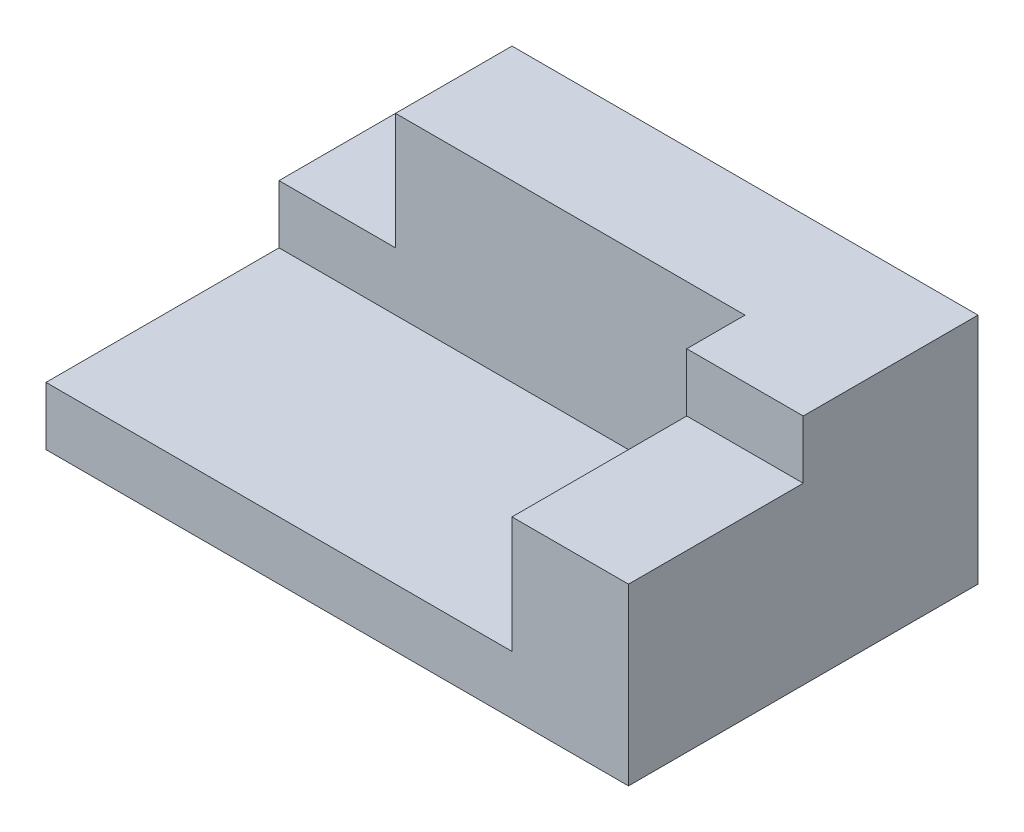
ISO-10303-21;
HEADER;
FILE_DESCRIPTION(('STEP AP214'),'2;1');
FILE_NAME('part.step','',(''),(''),'','','');
FILE_SCHEMA(('AUTOMOTIVE_DESIGN { 1 0 10303 214 1 1 1 1 }'));
ENDSEC;
DATA;
#1=APPLICATION_CONTEXT('core data for automotive mechanical design processes');
#2=APPLICATION_PROTOCOL_DEFINITION('international standard','automotive_design',2000,#1);
#3=PRODUCT_CONTEXT('',#1,'mechanical');
#4=PRODUCT('Part','Part','',(#3));
#5=PRODUCT_RELATED_PRODUCT_CATEGORY('part','',(#4));
#6=PRODUCT_DEFINITION_FORMATION('','',#4);
#7=PRODUCT_DEFINITION_CONTEXT('part definition',#1,'design');
#8=PRODUCT_DEFINITION('design','',#6,#7);
#9=PRODUCT_DEFINITION_SHAPE('','',#8);
#10=(LENGTH_UNIT() NAMED_UNIT(*) SI_UNIT(.MILLI.,.METRE.));
#11=(NAMED_UNIT(*) PLANE_ANGLE_UNIT() SI_UNIT($,.RADIAN.));
#12=(NAMED_UNIT(*) SI_UNIT($,.STERADIAN.) SOLID_ANGLE_UNIT());
#13=UNCERTAINTY_MEASURE_WITH_UNIT(LENGTH_MEASURE(1.E-05),#10,'distance_accuracy_value','');
#14=(GEOMETRIC_REPRESENTATION_CONTEXT(3) GLOBAL_UNCERTAINTY_ASSIGNED_CONTEXT((#13)) GLOBAL_UNIT_ASSIGNED_CONTEXT((#10,
#11,#12)) REPRESENTATION_CONTEXT('',''));
#15=CARTESIAN_POINT('',(0.,0.,0.));
#16=DIRECTION('',(0.,0.,1.));
#17=DIRECTION('',(1.,0.,0.));
#18=AXIS2_PLACEMENT_3D('',#15,#16,#17);
#19=CARTESIAN_POINT('',(-50.,10.,0.));
#20=DIRECTION('',(1.,0.,0.));
#21=DIRECTION('',(0.,0.,-1.));
#22=AXIS2_PLACEMENT_3D('',#19,#20,#21);
#23=PLANE('',#22);
#24=DIRECTION('',(0.,0.,1.));
#25=VECTOR('',#24,1.);
#26=CARTESIAN_POINT('',(-50.,0.,0.));
#27=LINE('',#26,#25);
#28=CARTESIAN_POINT('',(-50.,0.,-30.));
#29=VERTEX_POINT('',#28);
#30=CARTESIAN_POINT('',(-50.,0.,30.));
#31=VERTEX_POINT('',#30);
#32=EDGE_CURVE('E197',#29,#31,#27,.T.);
#33=ORIENTED_EDGE('',*,*,#32,.T.);
#34=DIRECTION('',(0.,-1.,0.));
#35=VECTOR('',#34,1.);
#36=CARTESIAN_POINT('',(-50.,10.,30.));
#37=LINE('',#36,#35);
#38=CARTESIAN_POINT('',(-50.,10.,30.));
#39=VERTEX_POINT('',#38);
#40=EDGE_CURVE('E11',#39,#31,#37,.T.);
#41=ORIENTED_EDGE('',*,*,#40,.F.);
#42=DIRECTION('',(0.,0.,1.));
#43=VECTOR('',#42,1.);
#44=CARTESIAN_POINT('',(-50.,10.,0.));
#45=LINE('',#44,#43);
#46=CARTESIAN_POINT('',(-50.,10.,-10.));
#47=VERTEX_POINT('',#46);
#48=EDGE_CURVE('E200',#47,#39,#45,.T.);
#49=ORIENTED_EDGE('',*,*,#48,.F.);
#50=DIRECTION('',(0.,-1.,0.));
#51=VECTOR('',#50,1.);
#52=CARTESIAN_POINT('',(-50.,20.,-10.));
#53=LINE('',#52,#51);
#54=CARTESIAN_POINT('',(-50.,20.,-10.));
#55=VERTEX_POINT('',#54);
#56=EDGE_CURVE('E128',#55,#47,#53,.T.);
#57=ORIENTED_EDGE('',*,*,#56,.F.);
#58=DIRECTION('',(0.,0.,1.));
#59=VECTOR('',#58,1.);
#60=CARTESIAN_POINT('',(-50.,20.,0.));
#61=LINE('',#60,#59);
#62=CARTESIAN_POINT('',(-50.,20.,-30.));
#63=VERTEX_POINT('',#62);
#64=EDGE_CURVE('E131',#63,#55,#61,.T.);
#65=ORIENTED_EDGE('',*,*,#64,.F.);
#66=DIRECTION('',(0.,-1.,0.));
#67=VECTOR('',#66,1.);
#68=CARTESIAN_POINT('',(-50.,20.,-30.));
#69=LINE('',#68,#67);
#70=EDGE_CURVE('E119',#63,#29,#69,.T.);
#71=ORIENTED_EDGE('',*,*,#70,.T.);
#72=EDGE_LOOP('',(#33,#41,#49,#57,#65,#71));
#73=FACE_BOUND('',#72,.T.);
#74=ADVANCED_FACE('F35',(#73),#23,.F.);
#75=CARTESIAN_POINT('',(0.,10.,30.));
#76=DIRECTION('',(0.,0.,-1.));
#77=DIRECTION('',(-1.,0.,0.));
#78=AXIS2_PLACEMENT_3D('',#75,#76,#77);
#79=PLANE('',#78);
#80=DIRECTION('',(1.,0.,0.));
#81=VECTOR('',#80,1.);
#82=CARTESIAN_POINT('',(0.,0.,30.));
#83=LINE('',#82,#81);
#84=CARTESIAN_POINT('',(50.,0.,30.));
#85=VERTEX_POINT('',#84);
#86=EDGE_CURVE('E201',#31,#85,#83,.T.);
#87=ORIENTED_EDGE('',*,*,#86,.T.);
#88=DIRECTION('',(0.,-1.,0.));
#89=VECTOR('',#88,1.);
#90=CARTESIAN_POINT('',(50.,30.,30.));
#91=LINE('',#90,#89);
#92=CARTESIAN_POINT('',(50.,30.,30.));
#93=VERTEX_POINT('',#92);
#94=EDGE_CURVE('E187',#93,#85,#91,.T.);
#95=ORIENTED_EDGE('',*,*,#94,.F.);
#96=DIRECTION('',(1.,0.,0.));
#97=VECTOR('',#96,1.);
#98=CARTESIAN_POINT('',(0.,30.,30.));
#99=LINE('',#98,#97);
#100=CARTESIAN_POINT('',(30.,30.,30.));
#101=VERTEX_POINT('',#100);
#102=EDGE_CURVE('E179',#101,#93,#99,.T.);
#103=ORIENTED_EDGE('',*,*,#102,.F.);
#104=DIRECTION('',(0.,-1.,0.));
#105=VECTOR('',#104,1.);
#106=CARTESIAN_POINT('',(30.,30.,30.));
#107=LINE('',#106,#105);
#108=CARTESIAN_POINT('',(30.,10.,30.));
#109=VERTEX_POINT('',#108);
#110=EDGE_CURVE('E192',#101,#109,#107,.T.);
#111=ORIENTED_EDGE('',*,*,#110,.T.);
#112=DIRECTION('',(1.,0.,0.));
#113=VECTOR('',#112,1.);
#114=CARTESIAN_POINT('',(0.,10.,30.));
#115=LINE('',#114,#113);
#116=EDGE_CURVE('E203',#39,#109,#115,.T.);
#117=ORIENTED_EDGE('',*,*,#116,.F.);
#118=ORIENTED_EDGE('',*,*,#40,.T.);
#119=EDGE_LOOP('',(#87,#95,#103,#111,#117,#118));
#120=FACE_BOUND('',#119,.T.);
#121=ADVANCED_FACE('F216',(#120),#79,.F.);
#122=CARTESIAN_POINT('',(0.,10.,0.));
#123=DIRECTION('',(0.,1.,0.));
#124=DIRECTION('',(0.,0.,1.));
#125=AXIS2_PLACEMENT_3D('',#122,#123,#124);
#126=PLANE('',#125);
#127=DIRECTION('',(1.,0.,0.));
#128=VECTOR('',#127,1.);
#129=CARTESIAN_POINT('',(0.,10.,-10.));
#130=LINE('',#129,#128);
#131=CARTESIAN_POINT('',(30.,10.,-10.));
#132=VERTEX_POINT('',#131);
#133=EDGE_CURVE('E198',#47,#132,#130,.T.);
#134=ORIENTED_EDGE('',*,*,#133,.F.);
#135=ORIENTED_EDGE('',*,*,#48,.T.);
#136=ORIENTED_EDGE('',*,*,#116,.T.);
#137=DIRECTION('',(0.,0.,-1.));
#138=VECTOR('',#137,1.);
#139=CARTESIAN_POINT('',(30.,10.,0.));
#140=LINE('',#139,#138);
#141=EDGE_CURVE('E43',#109,#132,#140,.T.);
#142=ORIENTED_EDGE('',*,*,#141,.T.);
#143=EDGE_LOOP('',(#134,#135,#136,#142));
#144=FACE_BOUND('',#143,.T.);
#145=ADVANCED_FACE('F213',(#144),#126,.T.);
#146=CARTESIAN_POINT('',(0.,0.,0.));
#147=DIRECTION('',(0.,1.,0.));
#148=DIRECTION('',(0.,0.,1.));
#149=AXIS2_PLACEMENT_3D('',#146,#147,#148);
#150=PLANE('',#149);
#151=ORIENTED_EDGE('',*,*,#32,.F.);
#152=DIRECTION('',(1.,0.,0.));
#153=VECTOR('',#152,1.);
#154=CARTESIAN_POINT('',(0.,0.,-30.));
#155=LINE('',#154,#153);
#156=CARTESIAN_POINT('',(50.,0.,-30.));
#157=VERTEX_POINT('',#156);
#158=EDGE_CURVE('E126',#29,#157,#155,.T.);
#159=ORIENTED_EDGE('',*,*,#158,.T.);
#160=DIRECTION('',(0.,0.,1.));
#161=VECTOR('',#160,1.);
#162=CARTESIAN_POINT('',(50.,0.,0.));
#163=LINE('',#162,#161);
#164=EDGE_CURVE('E175',#157,#85,#163,.T.);
#165=ORIENTED_EDGE('',*,*,#164,.T.);
#166=ORIENTED_EDGE('',*,*,#86,.F.);
#167=EDGE_LOOP('',(#151,#159,#165,#166));
#168=FACE_BOUND('',#167,.T.);
#169=ADVANCED_FACE('F235',(#168),#150,.F.);
#170=CARTESIAN_POINT('',(30.,30.,0.));
#171=DIRECTION('',(-1.,0.,0.));
#172=DIRECTION('',(0.,0.,1.));
#173=AXIS2_PLACEMENT_3D('',#170,#171,#172);
#174=PLANE('',#173);
#175=ORIENTED_EDGE('',*,*,#141,.F.);
#176=ORIENTED_EDGE('',*,*,#110,.F.);
#177=DIRECTION('',(0.,0.,-1.));
#178=VECTOR('',#177,1.);
#179=CARTESIAN_POINT('',(30.,30.,0.));
#180=LINE('',#179,#178);
#181=CARTESIAN_POINT('',(30.,30.,0.));
#182=VERTEX_POINT('',#181);
#183=EDGE_CURVE('E176',#101,#182,#180,.T.);
#184=ORIENTED_EDGE('',*,*,#183,.T.);
#185=DIRECTION('',(0.,-1.,0.));
#186=VECTOR('',#185,1.);
#187=CARTESIAN_POINT('',(30.,40.,0.));
#188=LINE('',#187,#186);
#189=CARTESIAN_POINT('',(30.,40.,0.));
#190=VERTEX_POINT('',#189);
#191=EDGE_CURVE('E168',#190,#182,#188,.T.);
#192=ORIENTED_EDGE('',*,*,#191,.F.);
#193=DIRECTION('',(0.,0.,-1.));
#194=VECTOR('',#193,1.);
#195=CARTESIAN_POINT('',(30.,40.,0.));
#196=LINE('',#195,#194);
#197=CARTESIAN_POINT('',(30.,40.,-10.));
#198=VERTEX_POINT('',#197);
#199=EDGE_CURVE('E149',#190,#198,#196,.T.);
#200=ORIENTED_EDGE('',*,*,#199,.T.);
#201=DIRECTION('',(0.,-1.,0.));
#202=VECTOR('',#201,1.);
#203=CARTESIAN_POINT('',(30.,40.,-10.));
#204=LINE('',#203,#202);
#205=EDGE_CURVE('E170',#198,#132,#204,.T.);
#206=ORIENTED_EDGE('',*,*,#205,.T.);
#207=EDGE_LOOP('',(#175,#176,#184,#192,#200,#206));
#208=FACE_BOUND('',#207,.T.);
#209=ADVANCED_FACE('F222',(#208),#174,.T.);
#210=CARTESIAN_POINT('',(50.,30.,0.));
#211=DIRECTION('',(1.,0.,0.));
#212=DIRECTION('',(0.,0.,-1.));
#213=AXIS2_PLACEMENT_3D('',#210,#211,#212);
#214=PLANE('',#213);
#215=ORIENTED_EDGE('',*,*,#164,.F.);
#216=DIRECTION('',(0.,-1.,0.));
#217=VECTOR('',#216,1.);
#218=CARTESIAN_POINT('',(50.,40.,-30.));
#219=LINE('',#218,#217);
#220=CARTESIAN_POINT('',(50.,40.,-30.));
#221=VERTEX_POINT('',#220);
#222=EDGE_CURVE('E163',#221,#157,#219,.T.);
#223=ORIENTED_EDGE('',*,*,#222,.F.);
#224=DIRECTION('',(0.,0.,1.));
#225=VECTOR('',#224,1.);
#226=CARTESIAN_POINT('',(50.,40.,0.));
#227=LINE('',#226,#225);
#228=CARTESIAN_POINT('',(50.,40.,0.));
#229=VERTEX_POINT('',#228);
#230=EDGE_CURVE('E155',#221,#229,#227,.T.);
#231=ORIENTED_EDGE('',*,*,#230,.T.);
#232=DIRECTION('',(0.,-1.,0.));
#233=VECTOR('',#232,1.);
#234=CARTESIAN_POINT('',(50.,40.,0.));
#235=LINE('',#234,#233);
#236=CARTESIAN_POINT('',(50.,30.,0.));
#237=VERTEX_POINT('',#236);
#238=EDGE_CURVE('E165',#229,#237,#235,.T.);
#239=ORIENTED_EDGE('',*,*,#238,.T.);
#240=DIRECTION('',(0.,0.,1.));
#241=VECTOR('',#240,1.);
#242=CARTESIAN_POINT('',(50.,30.,0.));
#243=LINE('',#242,#241);
#244=EDGE_CURVE('E181',#237,#93,#243,.T.);
#245=ORIENTED_EDGE('',*,*,#244,.T.);
#246=ORIENTED_EDGE('',*,*,#94,.T.);
#247=EDGE_LOOP('',(#215,#223,#231,#239,#245,#246));
#248=FACE_BOUND('',#247,.T.);
#249=ADVANCED_FACE('F236',(#248),#214,.T.);
#250=CARTESIAN_POINT('',(0.,30.,0.));
#251=DIRECTION('',(0.,1.,0.));
#252=DIRECTION('',(0.,0.,1.));
#253=AXIS2_PLACEMENT_3D('',#250,#251,#252);
#254=PLANE('',#253);
#255=ORIENTED_EDGE('',*,*,#183,.F.);
#256=ORIENTED_EDGE('',*,*,#102,.T.);
#257=ORIENTED_EDGE('',*,*,#244,.F.);
#258=DIRECTION('',(-1.,0.,0.));
#259=VECTOR('',#258,1.);
#260=CARTESIAN_POINT('',(0.,30.,0.));
#261=LINE('',#260,#259);
#262=EDGE_CURVE('E184',#237,#182,#261,.T.);
#263=ORIENTED_EDGE('',*,*,#262,.T.);
#264=EDGE_LOOP('',(#255,#256,#257,#263));
#265=FACE_BOUND('',#264,.T.);
#266=ADVANCED_FACE('F239',(#265),#254,.T.);
#267=CARTESIAN_POINT('',(-30.,40.,0.));
#268=DIRECTION('',(1.,0.,0.));
#269=DIRECTION('',(0.,0.,-1.));
#270=AXIS2_PLACEMENT_3D('',#267,#268,#269);
#271=PLANE('',#270);
#272=DIRECTION('',(0.,-1.,0.));
#273=VECTOR('',#272,1.);
#274=CARTESIAN_POINT('',(-30.,40.,-30.));
#275=LINE('',#274,#273);
#276=CARTESIAN_POINT('',(-30.,40.,-30.));
#277=VERTEX_POINT('',#276);
#278=CARTESIAN_POINT('',(-30.,20.,-30.));
#279=VERTEX_POINT('',#278);
#280=EDGE_CURVE('E56',#277,#279,#275,.T.);
#281=ORIENTED_EDGE('',*,*,#280,.T.);
#282=DIRECTION('',(0.,0.,1.));
#283=VECTOR('',#282,1.);
#284=CARTESIAN_POINT('',(-30.,20.,0.));
#285=LINE('',#284,#283);
#286=CARTESIAN_POINT('',(-30.,20.,-10.));
#287=VERTEX_POINT('',#286);
#288=EDGE_CURVE('E51',#279,#287,#285,.T.);
#289=ORIENTED_EDGE('',*,*,#288,.T.);
#290=DIRECTION('',(0.,-1.,0.));
#291=VECTOR('',#290,1.);
#292=CARTESIAN_POINT('',(-30.,40.,-10.));
#293=LINE('',#292,#291);
#294=CARTESIAN_POINT('',(-30.,40.,-10.));
#295=VERTEX_POINT('',#294);
#296=EDGE_CURVE('E173',#295,#287,#293,.T.);
#297=ORIENTED_EDGE('',*,*,#296,.F.);
#298=DIRECTION('',(0.,0.,1.));
#299=VECTOR('',#298,1.);
#300=CARTESIAN_POINT('',(-30.,40.,0.));
#301=LINE('',#300,#299);
#302=EDGE_CURVE('E144',#277,#295,#301,.T.);
#303=ORIENTED_EDGE('',*,*,#302,.F.);
#304=EDGE_LOOP('',(#281,#289,#297,#303));
#305=FACE_BOUND('',#304,.T.);
#306=ADVANCED_FACE('F227',(#305),#271,.F.);
#307=CARTESIAN_POINT('',(0.,40.,-10.));
#308=DIRECTION('',(0.,0.,-1.));
#309=DIRECTION('',(-1.,0.,0.));
#310=AXIS2_PLACEMENT_3D('',#307,#308,#309);
#311=PLANE('',#310);
#312=ORIENTED_EDGE('',*,*,#133,.T.);
#313=ORIENTED_EDGE('',*,*,#205,.F.);
#314=DIRECTION('',(1.,0.,0.));
#315=VECTOR('',#314,1.);
#316=CARTESIAN_POINT('',(0.,40.,-10.));
#317=LINE('',#316,#315);
#318=EDGE_CURVE('E147',#295,#198,#317,.T.);
#319=ORIENTED_EDGE('',*,*,#318,.F.);
#320=ORIENTED_EDGE('',*,*,#296,.T.);
#321=DIRECTION('',(1.,0.,0.));
#322=VECTOR('',#321,1.);
#323=CARTESIAN_POINT('',(0.,20.,-10.));
#324=LINE('',#323,#322);
#325=EDGE_CURVE('E136',#55,#287,#324,.T.);
#326=ORIENTED_EDGE('',*,*,#325,.F.);
#327=ORIENTED_EDGE('',*,*,#56,.T.);
#328=EDGE_LOOP('',(#312,#313,#319,#320,#326,#327));
#329=FACE_BOUND('',#328,.T.);
#330=ADVANCED_FACE('F226',(#329),#311,.F.);
#331=CARTESIAN_POINT('',(0.,40.,0.));
#332=DIRECTION('',(0.,0.,1.));
#333=DIRECTION('',(1.,0.,0.));
#334=AXIS2_PLACEMENT_3D('',#331,#332,#333);
#335=PLANE('',#334);
#336=ORIENTED_EDGE('',*,*,#191,.T.);
#337=ORIENTED_EDGE('',*,*,#262,.F.);
#338=ORIENTED_EDGE('',*,*,#238,.F.);
#339=DIRECTION('',(-1.,0.,0.));
#340=VECTOR('',#339,1.);
#341=CARTESIAN_POINT('',(0.,40.,0.));
#342=LINE('',#341,#340);
#343=EDGE_CURVE('E152',#229,#190,#342,.T.);
#344=ORIENTED_EDGE('',*,*,#343,.T.);
#345=EDGE_LOOP('',(#336,#337,#338,#344));
#346=FACE_BOUND('',#345,.T.);
#347=ADVANCED_FACE('F241',(#346),#335,.T.);
#348=CARTESIAN_POINT('',(0.,40.,-30.));
#349=DIRECTION('',(0.,0.,-1.));
#350=DIRECTION('',(-1.,0.,0.));
#351=AXIS2_PLACEMENT_3D('',#348,#349,#350);
#352=PLANE('',#351);
#353=ORIENTED_EDGE('',*,*,#158,.F.);
#354=ORIENTED_EDGE('',*,*,#70,.F.);
#355=DIRECTION('',(1.,0.,0.));
#356=VECTOR('',#355,1.);
#357=CARTESIAN_POINT('',(0.,20.,-30.));
#358=LINE('',#357,#356);
#359=EDGE_CURVE('E123',#63,#279,#358,.T.);
#360=ORIENTED_EDGE('',*,*,#359,.T.);
#361=ORIENTED_EDGE('',*,*,#280,.F.);
#362=DIRECTION('',(1.,0.,0.));
#363=VECTOR('',#362,1.);
#364=CARTESIAN_POINT('',(0.,40.,-30.));
#365=LINE('',#364,#363);
#366=EDGE_CURVE('E158',#277,#221,#365,.T.);
#367=ORIENTED_EDGE('',*,*,#366,.T.);
#368=ORIENTED_EDGE('',*,*,#222,.T.);
#369=EDGE_LOOP('',(#353,#354,#360,#361,#367,#368));
#370=FACE_BOUND('',#369,.T.);
#371=ADVANCED_FACE('F121',(#370),#352,.T.);
#372=CARTESIAN_POINT('',(0.,40.,0.));
#373=DIRECTION('',(0.,1.,0.));
#374=DIRECTION('',(0.,0.,1.));
#375=AXIS2_PLACEMENT_3D('',#372,#373,#374);
#376=PLANE('',#375);
#377=ORIENTED_EDGE('',*,*,#302,.T.);
#378=ORIENTED_EDGE('',*,*,#318,.T.);
#379=ORIENTED_EDGE('',*,*,#199,.F.);
#380=ORIENTED_EDGE('',*,*,#343,.F.);
#381=ORIENTED_EDGE('',*,*,#230,.F.);
#382=ORIENTED_EDGE('',*,*,#366,.F.);
#383=EDGE_LOOP('',(#377,#378,#379,#380,#381,#382));
#384=FACE_BOUND('',#383,.T.);
#385=ADVANCED_FACE('F231',(#384),#376,.T.);
#386=CARTESIAN_POINT('',(0.,20.,0.));
#387=DIRECTION('',(0.,1.,0.));
#388=DIRECTION('',(0.,0.,1.));
#389=AXIS2_PLACEMENT_3D('',#386,#387,#388);
#390=PLANE('',#389);
#391=ORIENTED_EDGE('',*,*,#288,.F.);
#392=ORIENTED_EDGE('',*,*,#359,.F.);
#393=ORIENTED_EDGE('',*,*,#64,.T.);
#394=ORIENTED_EDGE('',*,*,#325,.T.);
#395=EDGE_LOOP('',(#391,#392,#393,#394));
#396=FACE_BOUND('',#395,.T.);
#397=ADVANCED_FACE('F138',(#396),#390,.T.);
#398=CLOSED_SHELL('',(#74,#121,#145,#169,#209,#249,#266,#306,#330,#347,#371,#385,#397));
#399=MANIFOLD_SOLID_BREP('B2',#398);
#400=ADVANCED_BREP_SHAPE_REPRESENTATION('',(#18,#399),#14);
#401=SHAPE_DEFINITION_REPRESENTATION(#9,#400);
ENDSEC;
END-ISO-10303-21;
